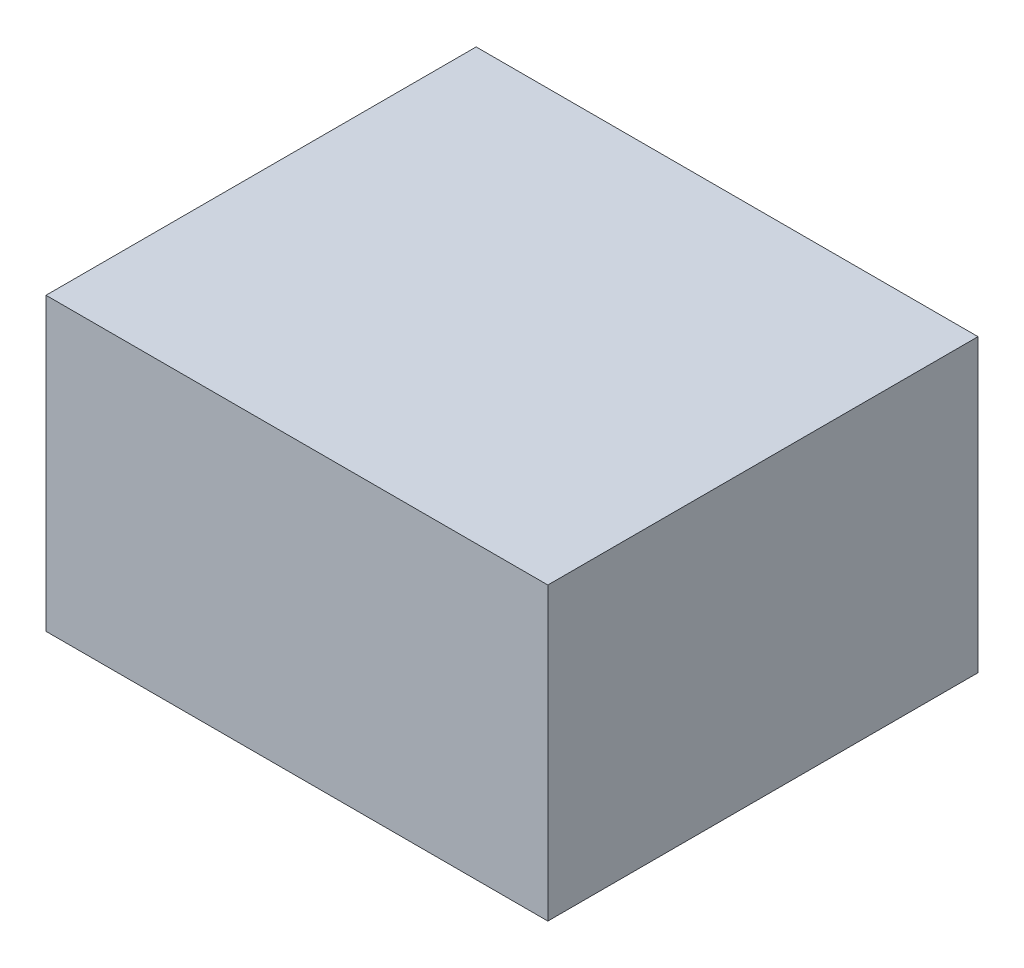
ISO-10303-21;
HEADER;
FILE_DESCRIPTION(('STEP AP214'),'2;1');
FILE_NAME('part.step','',(''),(''),'','','');
FILE_SCHEMA(('AUTOMOTIVE_DESIGN { 1 0 10303 214 1 1 1 1 }'));
ENDSEC;
DATA;
#1=APPLICATION_CONTEXT('core data for automotive mechanical design processes');
#2=APPLICATION_PROTOCOL_DEFINITION('international standard','automotive_design',2000,#1);
#3=PRODUCT_CONTEXT('',#1,'mechanical');
#4=PRODUCT('Part','Part','',(#3));
#5=PRODUCT_RELATED_PRODUCT_CATEGORY('part','',(#4));
#6=PRODUCT_DEFINITION_FORMATION('','',#4);
#7=PRODUCT_DEFINITION_CONTEXT('part definition',#1,'design');
#8=PRODUCT_DEFINITION('design','',#6,#7);
#9=PRODUCT_DEFINITION_SHAPE('','',#8);
#10=(LENGTH_UNIT() NAMED_UNIT(*) SI_UNIT(.MILLI.,.METRE.));
#11=(NAMED_UNIT(*) PLANE_ANGLE_UNIT() SI_UNIT($,.RADIAN.));
#12=(NAMED_UNIT(*) SI_UNIT($,.STERADIAN.) SOLID_ANGLE_UNIT());
#13=UNCERTAINTY_MEASURE_WITH_UNIT(LENGTH_MEASURE(1.E-05),#10,'distance_accuracy_value','');
#14=(GEOMETRIC_REPRESENTATION_CONTEXT(3) GLOBAL_UNCERTAINTY_ASSIGNED_CONTEXT((#13)) GLOBAL_UNIT_ASSIGNED_CONTEXT((#10,
#11,#12)) REPRESENTATION_CONTEXT('',''));
#15=CARTESIAN_POINT('',(0.,0.,0.));
#16=DIRECTION('',(0.,0.,1.));
#17=DIRECTION('',(1.,0.,0.));
#18=AXIS2_PLACEMENT_3D('',#15,#16,#17);
#19=CARTESIAN_POINT('',(0.8,0.475,-1.025));
#20=DIRECTION('',(0.,0.,1.));
#21=DIRECTION('',(1.,0.,0.));
#22=AXIS2_PLACEMENT_3D('',#19,#20,#21);
#23=PLANE('',#22);
#24=DIRECTION('',(-1.,0.,0.));
#25=VECTOR('',#24,1.);
#26=CARTESIAN_POINT('',(0.8,0.272,-1.025));
#27=LINE('',#26,#25);
#28=CARTESIAN_POINT('',(0.8,0.272,-1.025));
#29=VERTEX_POINT('',#28);
#30=CARTESIAN_POINT('',(0.449999999999999,0.272,-1.025));
#31=VERTEX_POINT('',#30);
#32=EDGE_CURVE('E11',#29,#31,#27,.T.);
#33=ORIENTED_EDGE('',*,*,#32,.T.);
#34=DIRECTION('',(0.,-1.,0.));
#35=VECTOR('',#34,1.);
#36=CARTESIAN_POINT('',(0.449999999999999,0.475,-1.025));
#37=LINE('',#36,#35);
#38=CARTESIAN_POINT('',(0.449999999999999,0.475,-1.025));
#39=VERTEX_POINT('',#38);
#40=EDGE_CURVE('E24',#39,#31,#37,.T.);
#41=ORIENTED_EDGE('',*,*,#40,.F.);
#42=DIRECTION('',(-1.,0.,0.));
#43=VECTOR('',#42,1.);
#44=CARTESIAN_POINT('',(0.8,0.475,-1.025));
#45=LINE('',#44,#43);
#46=CARTESIAN_POINT('',(0.8,0.475,-1.025));
#47=VERTEX_POINT('',#46);
#48=EDGE_CURVE('E88',#47,#39,#45,.T.);
#49=ORIENTED_EDGE('',*,*,#48,.F.);
#50=DIRECTION('',(0.,-1.,0.));
#51=VECTOR('',#50,1.);
#52=CARTESIAN_POINT('',(0.8,0.475,-1.025));
#53=LINE('',#52,#51);
#54=EDGE_CURVE('E77',#47,#29,#53,.T.);
#55=ORIENTED_EDGE('',*,*,#54,.T.);
#56=EDGE_LOOP('',(#33,#41,#49,#55));
#57=FACE_BOUND('',#56,.T.);
#58=ADVANCED_FACE('F17',(#57),#23,.F.);
#59=CARTESIAN_POINT('',(0.449999999999999,0.475,-1.025));
#60=DIRECTION('',(1.,0.,0.));
#61=DIRECTION('',(0.,0.,-1.));
#62=AXIS2_PLACEMENT_3D('',#59,#60,#61);
#63=PLANE('',#62);
#64=DIRECTION('',(0.,0.,1.));
#65=VECTOR('',#64,1.);
#66=CARTESIAN_POINT('',(0.449999999999999,0.272,-1.025));
#67=LINE('',#66,#65);
#68=CARTESIAN_POINT('',(0.449999999999999,0.272,-0.725));
#69=VERTEX_POINT('',#68);
#70=EDGE_CURVE('E85',#31,#69,#67,.T.);
#71=ORIENTED_EDGE('',*,*,#70,.T.);
#72=DIRECTION('',(0.,-1.,0.));
#73=VECTOR('',#72,1.);
#74=CARTESIAN_POINT('',(0.449999999999999,0.475,-0.725));
#75=LINE('',#74,#73);
#76=CARTESIAN_POINT('',(0.449999999999999,0.475,-0.725));
#77=VERTEX_POINT('',#76);
#78=EDGE_CURVE('E83',#77,#69,#75,.T.);
#79=ORIENTED_EDGE('',*,*,#78,.F.);
#80=DIRECTION('',(0.,0.,1.));
#81=VECTOR('',#80,1.);
#82=CARTESIAN_POINT('',(0.449999999999999,0.475,-1.025));
#83=LINE('',#82,#81);
#84=EDGE_CURVE('E72',#39,#77,#83,.T.);
#85=ORIENTED_EDGE('',*,*,#84,.F.);
#86=ORIENTED_EDGE('',*,*,#40,.T.);
#87=EDGE_LOOP('',(#71,#79,#85,#86));
#88=FACE_BOUND('',#87,.T.);
#89=ADVANCED_FACE('F90',(#88),#63,.F.);
#90=CARTESIAN_POINT('',(0.449999999999999,0.475,-0.725));
#91=DIRECTION('',(0.,0.,-1.));
#92=DIRECTION('',(-1.,0.,0.));
#93=AXIS2_PLACEMENT_3D('',#90,#91,#92);
#94=PLANE('',#93);
#95=DIRECTION('',(1.,0.,0.));
#96=VECTOR('',#95,1.);
#97=CARTESIAN_POINT('',(0.449999999999999,0.272,-0.725));
#98=LINE('',#97,#96);
#99=CARTESIAN_POINT('',(0.8,0.272,-0.725));
#100=VERTEX_POINT('',#99);
#101=EDGE_CURVE('E60',#69,#100,#98,.T.);
#102=ORIENTED_EDGE('',*,*,#101,.T.);
#103=DIRECTION('',(0.,-1.,0.));
#104=VECTOR('',#103,1.);
#105=CARTESIAN_POINT('',(0.8,0.475,-0.725));
#106=LINE('',#105,#104);
#107=CARTESIAN_POINT('',(0.8,0.475,-0.725));
#108=VERTEX_POINT('',#107);
#109=EDGE_CURVE('E54',#108,#100,#106,.T.);
#110=ORIENTED_EDGE('',*,*,#109,.F.);
#111=DIRECTION('',(1.,0.,0.));
#112=VECTOR('',#111,1.);
#113=CARTESIAN_POINT('',(0.449999999999999,0.475,-0.725));
#114=LINE('',#113,#112);
#115=EDGE_CURVE('E58',#77,#108,#114,.T.);
#116=ORIENTED_EDGE('',*,*,#115,.F.);
#117=ORIENTED_EDGE('',*,*,#78,.T.);
#118=EDGE_LOOP('',(#102,#110,#116,#117));
#119=FACE_BOUND('',#118,.T.);
#120=ADVANCED_FACE('F56',(#119),#94,.F.);
#121=CARTESIAN_POINT('',(0.8,0.475,-0.725));
#122=DIRECTION('',(-1.,0.,0.));
#123=DIRECTION('',(0.,0.,1.));
#124=AXIS2_PLACEMENT_3D('',#121,#122,#123);
#125=PLANE('',#124);
#126=DIRECTION('',(0.,0.,-1.));
#127=VECTOR('',#126,1.);
#128=CARTESIAN_POINT('',(0.8,0.272,-0.725));
#129=LINE('',#128,#127);
#130=EDGE_CURVE('E73',#100,#29,#129,.T.);
#131=ORIENTED_EDGE('',*,*,#130,.T.);
#132=ORIENTED_EDGE('',*,*,#54,.F.);
#133=DIRECTION('',(0.,0.,-1.));
#134=VECTOR('',#133,1.);
#135=CARTESIAN_POINT('',(0.8,0.475,-0.725));
#136=LINE('',#135,#134);
#137=EDGE_CURVE('E70',#108,#47,#136,.T.);
#138=ORIENTED_EDGE('',*,*,#137,.F.);
#139=ORIENTED_EDGE('',*,*,#109,.T.);
#140=EDGE_LOOP('',(#131,#132,#138,#139));
#141=FACE_BOUND('',#140,.T.);
#142=ADVANCED_FACE('F76',(#141),#125,.F.);
#143=CARTESIAN_POINT('',(0.,0.475,0.));
#144=DIRECTION('',(0.,1.,0.));
#145=DIRECTION('',(0.,0.,1.));
#146=AXIS2_PLACEMENT_3D('',#143,#144,#145);
#147=PLANE('',#146);
#148=ORIENTED_EDGE('',*,*,#48,.T.);
#149=ORIENTED_EDGE('',*,*,#84,.T.);
#150=ORIENTED_EDGE('',*,*,#115,.T.);
#151=ORIENTED_EDGE('',*,*,#137,.T.);
#152=EDGE_LOOP('',(#148,#149,#150,#151));
#153=FACE_BOUND('',#152,.T.);
#154=ADVANCED_FACE('F69',(#153),#147,.T.);
#155=CARTESIAN_POINT('',(0.,0.272,0.));
#156=DIRECTION('',(0.,1.,0.));
#157=DIRECTION('',(0.,0.,1.));
#158=AXIS2_PLACEMENT_3D('',#155,#156,#157);
#159=PLANE('',#158);
#160=ORIENTED_EDGE('',*,*,#32,.F.);
#161=ORIENTED_EDGE('',*,*,#130,.F.);
#162=ORIENTED_EDGE('',*,*,#101,.F.);
#163=ORIENTED_EDGE('',*,*,#70,.F.);
#164=EDGE_LOOP('',(#160,#161,#162,#163));
#165=FACE_BOUND('',#164,.T.);
#166=ADVANCED_FACE('F91',(#165),#159,.F.);
#167=CLOSED_SHELL('',(#58,#89,#120,#142,#154,#166));
#168=MANIFOLD_SOLID_BREP('B1',#167);
#169=ADVANCED_BREP_SHAPE_REPRESENTATION('',(#18,#168),#14);
#170=SHAPE_DEFINITION_REPRESENTATION(#9,#169);
ENDSEC;
END-ISO-10303-21;
